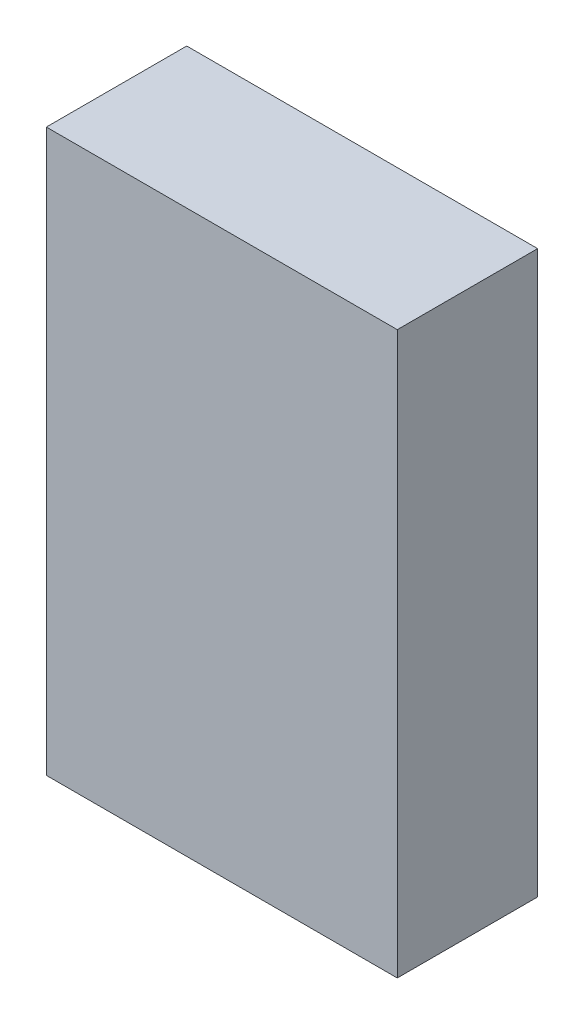
ISO-10303-21;
HEADER;
FILE_DESCRIPTION(('STEP AP214'),'2;1');
FILE_NAME('part.step','',(''),(''),'','','');
FILE_SCHEMA(('AUTOMOTIVE_DESIGN { 1 0 10303 214 1 1 1 1 }'));
ENDSEC;
DATA;
#1=APPLICATION_CONTEXT('core data for automotive mechanical design processes');
#2=APPLICATION_PROTOCOL_DEFINITION('international standard','automotive_design',2000,#1);
#3=PRODUCT_CONTEXT('',#1,'mechanical');
#4=PRODUCT('Part','Part','',(#3));
#5=PRODUCT_RELATED_PRODUCT_CATEGORY('part','',(#4));
#6=PRODUCT_DEFINITION_FORMATION('','',#4);
#7=PRODUCT_DEFINITION_CONTEXT('part definition',#1,'design');
#8=PRODUCT_DEFINITION('design','',#6,#7);
#9=PRODUCT_DEFINITION_SHAPE('','',#8);
#10=(LENGTH_UNIT() NAMED_UNIT(*) SI_UNIT(.MILLI.,.METRE.));
#11=(NAMED_UNIT(*) PLANE_ANGLE_UNIT() SI_UNIT($,.RADIAN.));
#12=(NAMED_UNIT(*) SI_UNIT($,.STERADIAN.) SOLID_ANGLE_UNIT());
#13=UNCERTAINTY_MEASURE_WITH_UNIT(LENGTH_MEASURE(1.E-05),#10,'distance_accuracy_value','');
#14=(GEOMETRIC_REPRESENTATION_CONTEXT(3) GLOBAL_UNCERTAINTY_ASSIGNED_CONTEXT((#13)) GLOBAL_UNIT_ASSIGNED_CONTEXT((#10,
#11,#12)) REPRESENTATION_CONTEXT('',''));
#15=CARTESIAN_POINT('',(0.,0.,0.));
#16=DIRECTION('',(0.,0.,1.));
#17=DIRECTION('',(1.,0.,0.));
#18=AXIS2_PLACEMENT_3D('',#15,#16,#17);
#19=CARTESIAN_POINT('',(7.9375,12.7,6.35));
#20=DIRECTION('',(-1.,0.,0.));
#21=DIRECTION('',(0.,-1.,0.));
#22=AXIS2_PLACEMENT_3D('',#19,#20,#21);
#23=PLANE('',#22);
#24=DIRECTION('',(0.,1.,0.));
#25=VECTOR('',#24,1.);
#26=CARTESIAN_POINT('',(7.9375,12.7,0.));
#27=LINE('',#26,#25);
#28=CARTESIAN_POINT('',(7.9375,-12.7,0.));
#29=VERTEX_POINT('',#28);
#30=CARTESIAN_POINT('',(7.9375,12.7,0.));
#31=VERTEX_POINT('',#30);
#32=EDGE_CURVE('E96',#29,#31,#27,.T.);
#33=ORIENTED_EDGE('',*,*,#32,.T.);
#34=DIRECTION('',(0.,0.,-1.));
#35=VECTOR('',#34,1.);
#36=CARTESIAN_POINT('',(7.9375,12.7,6.35));
#37=LINE('',#36,#35);
#38=CARTESIAN_POINT('',(7.9375,12.7,6.35));
#39=VERTEX_POINT('',#38);
#40=EDGE_CURVE('E11',#39,#31,#37,.T.);
#41=ORIENTED_EDGE('',*,*,#40,.F.);
#42=DIRECTION('',(0.,1.,0.));
#43=VECTOR('',#42,1.);
#44=CARTESIAN_POINT('',(7.9375,12.7,6.35));
#45=LINE('',#44,#43);
#46=CARTESIAN_POINT('',(7.9375,-12.7,6.35));
#47=VERTEX_POINT('',#46);
#48=EDGE_CURVE('E84',#47,#39,#45,.T.);
#49=ORIENTED_EDGE('',*,*,#48,.F.);
#50=DIRECTION('',(0.,0.,-1.));
#51=VECTOR('',#50,1.);
#52=CARTESIAN_POINT('',(7.9375,-12.7,6.35));
#53=LINE('',#52,#51);
#54=EDGE_CURVE('E92',#47,#29,#53,.T.);
#55=ORIENTED_EDGE('',*,*,#54,.T.);
#56=EDGE_LOOP('',(#33,#41,#49,#55));
#57=FACE_BOUND('',#56,.T.);
#58=ADVANCED_FACE('F33',(#57),#23,.F.);
#59=CARTESIAN_POINT('',(-7.9375,12.7,6.35));
#60=DIRECTION('',(0.,-1.,0.));
#61=DIRECTION('',(0.,0.,-1.));
#62=AXIS2_PLACEMENT_3D('',#59,#60,#61);
#63=PLANE('',#62);
#64=DIRECTION('',(-1.,0.,0.));
#65=VECTOR('',#64,1.);
#66=CARTESIAN_POINT('',(-7.9375,12.7,0.));
#67=LINE('',#66,#65);
#68=CARTESIAN_POINT('',(-7.9375,12.7,0.));
#69=VERTEX_POINT('',#68);
#70=EDGE_CURVE('E88',#31,#69,#67,.T.);
#71=ORIENTED_EDGE('',*,*,#70,.T.);
#72=DIRECTION('',(0.,0.,-1.));
#73=VECTOR('',#72,1.);
#74=CARTESIAN_POINT('',(-7.9375,12.7,6.35));
#75=LINE('',#74,#73);
#76=CARTESIAN_POINT('',(-7.9375,12.7,6.35));
#77=VERTEX_POINT('',#76);
#78=EDGE_CURVE('E41',#77,#69,#75,.T.);
#79=ORIENTED_EDGE('',*,*,#78,.F.);
#80=DIRECTION('',(-1.,0.,0.));
#81=VECTOR('',#80,1.);
#82=CARTESIAN_POINT('',(-7.9375,12.7,6.35));
#83=LINE('',#82,#81);
#84=EDGE_CURVE('E79',#39,#77,#83,.T.);
#85=ORIENTED_EDGE('',*,*,#84,.F.);
#86=ORIENTED_EDGE('',*,*,#40,.T.);
#87=EDGE_LOOP('',(#71,#79,#85,#86));
#88=FACE_BOUND('',#87,.T.);
#89=ADVANCED_FACE('F87',(#88),#63,.F.);
#90=CARTESIAN_POINT('',(-7.9375,12.7,6.35));
#91=DIRECTION('',(1.,0.,0.));
#92=DIRECTION('',(0.,1.,0.));
#93=AXIS2_PLACEMENT_3D('',#90,#91,#92);
#94=PLANE('',#93);
#95=DIRECTION('',(0.,-1.,0.));
#96=VECTOR('',#95,1.);
#97=CARTESIAN_POINT('',(-7.9375,12.7,0.));
#98=LINE('',#97,#96);
#99=CARTESIAN_POINT('',(-7.9375,-12.7,0.));
#100=VERTEX_POINT('',#99);
#101=EDGE_CURVE('E66',#69,#100,#98,.T.);
#102=ORIENTED_EDGE('',*,*,#101,.T.);
#103=DIRECTION('',(0.,0.,-1.));
#104=VECTOR('',#103,1.);
#105=CARTESIAN_POINT('',(-7.9375,-12.7,6.35));
#106=LINE('',#105,#104);
#107=CARTESIAN_POINT('',(-7.9375,-12.7,6.35));
#108=VERTEX_POINT('',#107);
#109=EDGE_CURVE('E89',#108,#100,#106,.T.);
#110=ORIENTED_EDGE('',*,*,#109,.F.);
#111=DIRECTION('',(0.,-1.,0.));
#112=VECTOR('',#111,1.);
#113=CARTESIAN_POINT('',(-7.9375,12.7,6.35));
#114=LINE('',#113,#112);
#115=EDGE_CURVE('E82',#77,#108,#114,.T.);
#116=ORIENTED_EDGE('',*,*,#115,.F.);
#117=ORIENTED_EDGE('',*,*,#78,.T.);
#118=EDGE_LOOP('',(#102,#110,#116,#117));
#119=FACE_BOUND('',#118,.T.);
#120=ADVANCED_FACE('F90',(#119),#94,.F.);
#121=CARTESIAN_POINT('',(-7.9375,-12.7,6.35));
#122=DIRECTION('',(0.,1.,0.));
#123=DIRECTION('',(0.,0.,1.));
#124=AXIS2_PLACEMENT_3D('',#121,#122,#123);
#125=PLANE('',#124);
#126=DIRECTION('',(1.,0.,0.));
#127=VECTOR('',#126,1.);
#128=CARTESIAN_POINT('',(-7.9375,-12.7,0.));
#129=LINE('',#128,#127);
#130=EDGE_CURVE('E72',#100,#29,#129,.T.);
#131=ORIENTED_EDGE('',*,*,#130,.T.);
#132=ORIENTED_EDGE('',*,*,#54,.F.);
#133=DIRECTION('',(1.,0.,0.));
#134=VECTOR('',#133,1.);
#135=CARTESIAN_POINT('',(-7.9375,-12.7,6.35));
#136=LINE('',#135,#134);
#137=EDGE_CURVE('E49',#108,#47,#136,.T.);
#138=ORIENTED_EDGE('',*,*,#137,.F.);
#139=ORIENTED_EDGE('',*,*,#109,.T.);
#140=EDGE_LOOP('',(#131,#132,#138,#139));
#141=FACE_BOUND('',#140,.T.);
#142=ADVANCED_FACE('F103',(#141),#125,.F.);
#143=CARTESIAN_POINT('',(0.,0.,6.35));
#144=DIRECTION('',(0.,0.,1.));
#145=DIRECTION('',(1.,0.,0.));
#146=AXIS2_PLACEMENT_3D('',#143,#144,#145);
#147=PLANE('',#146);
#148=ORIENTED_EDGE('',*,*,#48,.T.);
#149=ORIENTED_EDGE('',*,*,#84,.T.);
#150=ORIENTED_EDGE('',*,*,#115,.T.);
#151=ORIENTED_EDGE('',*,*,#137,.T.);
#152=EDGE_LOOP('',(#148,#149,#150,#151));
#153=FACE_BOUND('',#152,.T.);
#154=ADVANCED_FACE('F80',(#153),#147,.T.);
#155=CARTESIAN_POINT('',(0.,0.,0.));
#156=DIRECTION('',(0.,0.,1.));
#157=DIRECTION('',(1.,0.,0.));
#158=AXIS2_PLACEMENT_3D('',#155,#156,#157);
#159=PLANE('',#158);
#160=ORIENTED_EDGE('',*,*,#32,.F.);
#161=ORIENTED_EDGE('',*,*,#130,.F.);
#162=ORIENTED_EDGE('',*,*,#101,.F.);
#163=ORIENTED_EDGE('',*,*,#70,.F.);
#164=EDGE_LOOP('',(#160,#161,#162,#163));
#165=FACE_BOUND('',#164,.T.);
#166=ADVANCED_FACE('F106',(#165),#159,.F.);
#167=CLOSED_SHELL('',(#58,#89,#120,#142,#154,#166));
#168=MANIFOLD_SOLID_BREP('B2',#167);
#169=ADVANCED_BREP_SHAPE_REPRESENTATION('',(#18,#168),#14);
#170=SHAPE_DEFINITION_REPRESENTATION(#9,#169);
ENDSEC;
END-ISO-10303-21;
